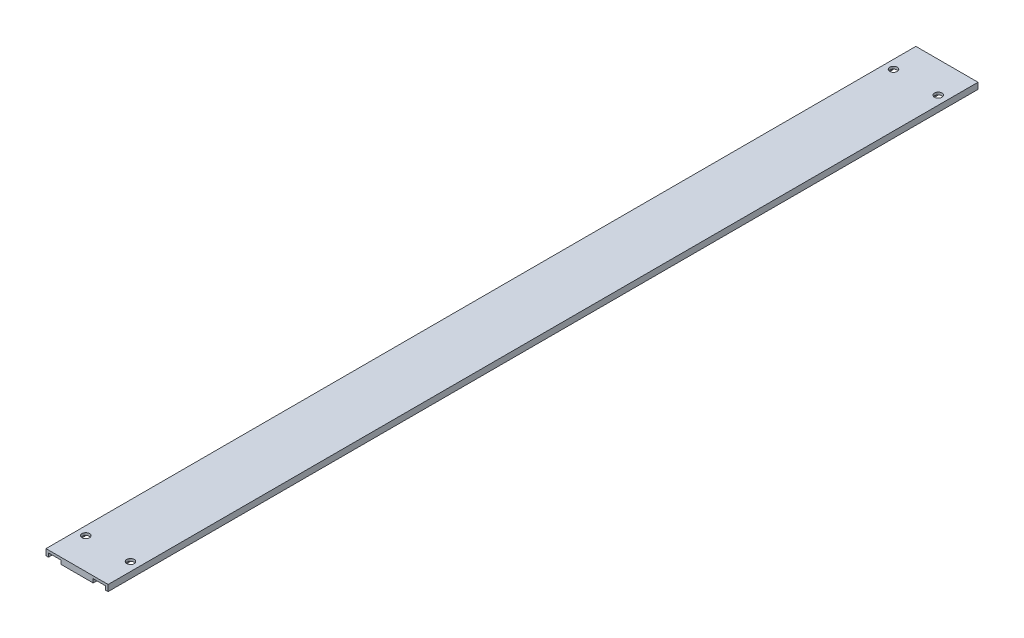
ISO-10303-21;
HEADER;
FILE_DESCRIPTION(('STEP AP214'),'2;1');
FILE_NAME('part.step','',(''),(''),'','','');
FILE_SCHEMA(('AUTOMOTIVE_DESIGN { 1 0 10303 214 1 1 1 1 }'));
ENDSEC;
DATA;
#1=APPLICATION_CONTEXT('core data for automotive mechanical design processes');
#2=APPLICATION_PROTOCOL_DEFINITION('international standard','automotive_design',2000,#1);
#3=PRODUCT_CONTEXT('',#1,'mechanical');
#4=PRODUCT('Part','Part','',(#3));
#5=PRODUCT_RELATED_PRODUCT_CATEGORY('part','',(#4));
#6=PRODUCT_DEFINITION_FORMATION('','',#4);
#7=PRODUCT_DEFINITION_CONTEXT('part definition',#1,'design');
#8=PRODUCT_DEFINITION('design','',#6,#7);
#9=PRODUCT_DEFINITION_SHAPE('','',#8);
#10=(LENGTH_UNIT() NAMED_UNIT(*) SI_UNIT(.MILLI.,.METRE.));
#11=(NAMED_UNIT(*) PLANE_ANGLE_UNIT() SI_UNIT($,.RADIAN.));
#12=(NAMED_UNIT(*) SI_UNIT($,.STERADIAN.) SOLID_ANGLE_UNIT());
#13=UNCERTAINTY_MEASURE_WITH_UNIT(LENGTH_MEASURE(1.E-05),#10,'distance_accuracy_value','');
#14=(GEOMETRIC_REPRESENTATION_CONTEXT(3) GLOBAL_UNCERTAINTY_ASSIGNED_CONTEXT((#13)) GLOBAL_UNIT_ASSIGNED_CONTEXT((#10,
#11,#12)) REPRESENTATION_CONTEXT('',''));
#15=CARTESIAN_POINT('',(0.,0.,0.));
#16=DIRECTION('',(0.,0.,1.));
#17=DIRECTION('',(1.,0.,0.));
#18=AXIS2_PLACEMENT_3D('',#15,#16,#17);
#19=CARTESIAN_POINT('',(0.,0.,0.));
#20=DIRECTION('',(0.,1.,0.));
#21=DIRECTION('',(0.,0.,1.));
#22=AXIS2_PLACEMENT_3D('',#19,#20,#21);
#23=PLANE('',#22);
#24=DIRECTION('',(-1.,0.,0.));
#25=VECTOR('',#24,1.);
#26=CARTESIAN_POINT('',(50.,0.,-700.));
#27=LINE('',#26,#25);
#28=CARTESIAN_POINT('',(2.,0.,-700.));
#29=VERTEX_POINT('',#28);
#30=CARTESIAN_POINT('',(0.,0.,-700.));
#31=VERTEX_POINT('',#30);
#32=EDGE_CURVE('E253',#29,#31,#27,.T.);
#33=ORIENTED_EDGE('',*,*,#32,.F.);
#34=DIRECTION('',(0.,0.,-1.));
#35=VECTOR('',#34,1.);
#36=CARTESIAN_POINT('',(2.,0.,-700.));
#37=LINE('',#36,#35);
#38=CARTESIAN_POINT('',(2.,0.,0.));
#39=VERTEX_POINT('',#38);
#40=EDGE_CURVE('E149',#39,#29,#37,.T.);
#41=ORIENTED_EDGE('',*,*,#40,.F.);
#42=DIRECTION('',(1.,0.,0.));
#43=VECTOR('',#42,1.);
#44=CARTESIAN_POINT('',(0.,0.,0.));
#45=LINE('',#44,#43);
#46=CARTESIAN_POINT('',(0.,0.,0.));
#47=VERTEX_POINT('',#46);
#48=EDGE_CURVE('E245',#47,#39,#45,.T.);
#49=ORIENTED_EDGE('',*,*,#48,.F.);
#50=DIRECTION('',(0.,0.,1.));
#51=VECTOR('',#50,1.);
#52=CARTESIAN_POINT('',(0.,0.,-700.));
#53=LINE('',#52,#51);
#54=EDGE_CURVE('E225',#31,#47,#53,.T.);
#55=ORIENTED_EDGE('',*,*,#54,.F.);
#56=EDGE_LOOP('',(#33,#41,#49,#55));
#57=FACE_BOUND('',#56,.T.);
#58=ADVANCED_FACE('F39',(#57),#23,.F.);
#59=CARTESIAN_POINT('',(12.,0.,0.));
#60=VERTEX_POINT('',#59);
#61=CARTESIAN_POINT('',(38.,0.,0.));
#62=VERTEX_POINT('',#61);
#63=EDGE_CURVE('E250',#60,#62,#45,.T.);
#64=ORIENTED_EDGE('',*,*,#63,.F.);
#65=DIRECTION('',(0.,0.,1.));
#66=VECTOR('',#65,1.);
#67=CARTESIAN_POINT('',(12.,0.,0.));
#68=LINE('',#67,#66);
#69=CARTESIAN_POINT('',(12.,0.,-700.));
#70=VERTEX_POINT('',#69);
#71=EDGE_CURVE('E191',#70,#60,#68,.T.);
#72=ORIENTED_EDGE('',*,*,#71,.F.);
#73=CARTESIAN_POINT('',(38.,0.,-700.));
#74=VERTEX_POINT('',#73);
#75=EDGE_CURVE('E155',#74,#70,#27,.T.);
#76=ORIENTED_EDGE('',*,*,#75,.F.);
#77=DIRECTION('',(0.,0.,-1.));
#78=VECTOR('',#77,1.);
#79=CARTESIAN_POINT('',(38.,0.,0.));
#80=LINE('',#79,#78);
#81=EDGE_CURVE('E183',#62,#74,#80,.T.);
#82=ORIENTED_EDGE('',*,*,#81,.F.);
#83=EDGE_LOOP('',(#64,#72,#76,#82));
#84=FACE_BOUND('',#83,.T.);
#85=ADVANCED_FACE('F313',(#84),#23,.F.);
#86=CARTESIAN_POINT('',(43.,0.,-25.));
#87=DIRECTION('',(0.,1.,0.));
#88=DIRECTION('',(0.,0.,1.));
#89=AXIS2_PLACEMENT_3D('',#86,#87,#88);
#90=CYLINDRICAL_SURFACE('',#89,3.);
#91=CARTESIAN_POINT('',(43.,5.,-25.));
#92=DIRECTION('',(0.,1.,0.));
#93=DIRECTION('',(0.,0.,1.));
#94=AXIS2_PLACEMENT_3D('',#91,#92,#93);
#95=CIRCLE('',#94,3.);
#96=CARTESIAN_POINT('',(43.,5.,-22.));
#97=VERTEX_POINT('',#96);
#98=EDGE_CURVE('E218',#97,#97,#95,.T.);
#99=ORIENTED_EDGE('',*,*,#98,.T.);
#100=EDGE_LOOP('',(#99));
#101=FACE_BOUND('',#100,.T.);
#102=CARTESIAN_POINT('',(43.,3.,-25.));
#103=DIRECTION('',(0.,-1.,0.));
#104=DIRECTION('',(0.,0.,-1.));
#105=AXIS2_PLACEMENT_3D('',#102,#103,#104);
#106=CIRCLE('',#105,3.);
#107=CARTESIAN_POINT('',(43.,3.,-28.));
#108=VERTEX_POINT('',#107);
#109=EDGE_CURVE('E205',#108,#108,#106,.F.);
#110=ORIENTED_EDGE('',*,*,#109,.F.);
#111=EDGE_LOOP('',(#110));
#112=FACE_BOUND('',#111,.T.);
#113=ADVANCED_FACE('F305',(#101,#112),#90,.F.);
#114=CARTESIAN_POINT('',(43.,0.,-675.));
#115=DIRECTION('',(0.,1.,0.));
#116=DIRECTION('',(0.,0.,1.));
#117=AXIS2_PLACEMENT_3D('',#114,#115,#116);
#118=CYLINDRICAL_SURFACE('',#117,3.);
#119=CARTESIAN_POINT('',(43.,5.,-675.));
#120=DIRECTION('',(0.,1.,0.));
#121=DIRECTION('',(0.,0.,1.));
#122=AXIS2_PLACEMENT_3D('',#119,#120,#121);
#123=CIRCLE('',#122,3.);
#124=CARTESIAN_POINT('',(43.,5.,-672.));
#125=VERTEX_POINT('',#124);
#126=EDGE_CURVE('E213',#125,#125,#123,.T.);
#127=ORIENTED_EDGE('',*,*,#126,.T.);
#128=EDGE_LOOP('',(#127));
#129=FACE_BOUND('',#128,.T.);
#130=CARTESIAN_POINT('',(43.,3.,-675.));
#131=DIRECTION('',(0.,-1.,0.));
#132=DIRECTION('',(0.,0.,-1.));
#133=AXIS2_PLACEMENT_3D('',#130,#131,#132);
#134=CIRCLE('',#133,3.);
#135=CARTESIAN_POINT('',(43.,3.,-678.));
#136=VERTEX_POINT('',#135);
#137=EDGE_CURVE('E43',#136,#136,#134,.F.);
#138=ORIENTED_EDGE('',*,*,#137,.F.);
#139=EDGE_LOOP('',(#138));
#140=FACE_BOUND('',#139,.T.);
#141=ADVANCED_FACE('F303',(#129,#140),#118,.F.);
#142=CARTESIAN_POINT('',(0.,5.,-700.));
#143=DIRECTION('',(1.,0.,0.));
#144=DIRECTION('',(0.,0.,-1.));
#145=AXIS2_PLACEMENT_3D('',#142,#143,#144);
#146=PLANE('',#145);
#147=ORIENTED_EDGE('',*,*,#54,.T.);
#148=DIRECTION('',(0.,-1.,0.));
#149=VECTOR('',#148,1.);
#150=CARTESIAN_POINT('',(0.,5.,0.));
#151=LINE('',#150,#149);
#152=CARTESIAN_POINT('',(0.,5.,0.));
#153=VERTEX_POINT('',#152);
#154=EDGE_CURVE('E11',#153,#47,#151,.T.);
#155=ORIENTED_EDGE('',*,*,#154,.F.);
#156=DIRECTION('',(0.,0.,1.));
#157=VECTOR('',#156,1.);
#158=CARTESIAN_POINT('',(0.,5.,-700.));
#159=LINE('',#158,#157);
#160=CARTESIAN_POINT('',(0.,5.,-700.));
#161=VERTEX_POINT('',#160);
#162=EDGE_CURVE('E226',#161,#153,#159,.T.);
#163=ORIENTED_EDGE('',*,*,#162,.F.);
#164=DIRECTION('',(0.,-1.,0.));
#165=VECTOR('',#164,1.);
#166=CARTESIAN_POINT('',(0.,5.,-700.));
#167=LINE('',#166,#165);
#168=EDGE_CURVE('E240',#161,#31,#167,.T.);
#169=ORIENTED_EDGE('',*,*,#168,.T.);
#170=EDGE_LOOP('',(#147,#155,#163,#169));
#171=FACE_BOUND('',#170,.T.);
#172=ADVANCED_FACE('F41',(#171),#146,.F.);
#173=CARTESIAN_POINT('',(0.,5.,0.));
#174=DIRECTION('',(0.,0.,-1.));
#175=DIRECTION('',(-1.,0.,0.));
#176=AXIS2_PLACEMENT_3D('',#173,#174,#175);
#177=PLANE('',#176);
#178=ORIENTED_EDGE('',*,*,#48,.T.);
#179=DIRECTION('',(0.,-1.,0.));
#180=VECTOR('',#179,1.);
#181=CARTESIAN_POINT('',(2.,3.,0.));
#182=LINE('',#181,#180);
#183=CARTESIAN_POINT('',(2.,3.,0.));
#184=VERTEX_POINT('',#183);
#185=EDGE_CURVE('E160',#184,#39,#182,.T.);
#186=ORIENTED_EDGE('',*,*,#185,.F.);
#187=DIRECTION('',(-1.,0.,0.));
#188=VECTOR('',#187,1.);
#189=CARTESIAN_POINT('',(2.,3.,0.));
#190=LINE('',#189,#188);
#191=CARTESIAN_POINT('',(12.,3.,0.));
#192=VERTEX_POINT('',#191);
#193=EDGE_CURVE('E137',#192,#184,#190,.T.);
#194=ORIENTED_EDGE('',*,*,#193,.F.);
#195=DIRECTION('',(0.,-1.,0.));
#196=VECTOR('',#195,1.);
#197=CARTESIAN_POINT('',(12.,3.,0.));
#198=LINE('',#197,#196);
#199=EDGE_CURVE('E133',#192,#60,#198,.T.);
#200=ORIENTED_EDGE('',*,*,#199,.T.);
#201=ORIENTED_EDGE('',*,*,#63,.T.);
#202=DIRECTION('',(0.,-1.,0.));
#203=VECTOR('',#202,1.);
#204=CARTESIAN_POINT('',(38.,3.,0.));
#205=LINE('',#204,#203);
#206=CARTESIAN_POINT('',(38.,3.,0.));
#207=VERTEX_POINT('',#206);
#208=EDGE_CURVE('E188',#207,#62,#205,.T.);
#209=ORIENTED_EDGE('',*,*,#208,.F.);
#210=DIRECTION('',(-1.,0.,0.));
#211=VECTOR('',#210,1.);
#212=CARTESIAN_POINT('',(38.,3.,0.));
#213=LINE('',#212,#211);
#214=CARTESIAN_POINT('',(48.,3.,0.));
#215=VERTEX_POINT('',#214);
#216=EDGE_CURVE('E178',#215,#207,#213,.T.);
#217=ORIENTED_EDGE('',*,*,#216,.F.);
#218=DIRECTION('',(0.,-1.,0.));
#219=VECTOR('',#218,1.);
#220=CARTESIAN_POINT('',(48.,3.,0.));
#221=LINE('',#220,#219);
#222=CARTESIAN_POINT('',(48.,0.,0.));
#223=VERTEX_POINT('',#222);
#224=EDGE_CURVE('E192',#215,#223,#221,.T.);
#225=ORIENTED_EDGE('',*,*,#224,.T.);
#226=CARTESIAN_POINT('',(50.,0.,0.));
#227=VERTEX_POINT('',#226);
#228=EDGE_CURVE('E244',#223,#227,#45,.T.);
#229=ORIENTED_EDGE('',*,*,#228,.T.);
#230=DIRECTION('',(0.,-1.,0.));
#231=VECTOR('',#230,1.);
#232=CARTESIAN_POINT('',(50.,5.,0.));
#233=LINE('',#232,#231);
#234=CARTESIAN_POINT('',(50.,5.,0.));
#235=VERTEX_POINT('',#234);
#236=EDGE_CURVE('E49',#235,#227,#233,.T.);
#237=ORIENTED_EDGE('',*,*,#236,.F.);
#238=DIRECTION('',(1.,0.,0.));
#239=VECTOR('',#238,1.);
#240=CARTESIAN_POINT('',(0.,5.,0.));
#241=LINE('',#240,#239);
#242=EDGE_CURVE('E230',#153,#235,#241,.T.);
#243=ORIENTED_EDGE('',*,*,#242,.F.);
#244=ORIENTED_EDGE('',*,*,#154,.T.);
#245=EDGE_LOOP('',(#178,#186,#194,#200,#201,#209,#217,#225,#229,#237,#243,#244));
#246=FACE_BOUND('',#245,.T.);
#247=ADVANCED_FACE('F286',(#246),#177,.F.);
#248=CARTESIAN_POINT('',(50.,5.,0.));
#249=DIRECTION('',(-1.,0.,0.));
#250=DIRECTION('',(0.,0.,1.));
#251=AXIS2_PLACEMENT_3D('',#248,#249,#250);
#252=PLANE('',#251);
#253=DIRECTION('',(0.,0.,-1.));
#254=VECTOR('',#253,1.);
#255=CARTESIAN_POINT('',(50.,0.,0.));
#256=LINE('',#255,#254);
#257=CARTESIAN_POINT('',(50.,0.,-700.));
#258=VERTEX_POINT('',#257);
#259=EDGE_CURVE('E249',#227,#258,#256,.T.);
#260=ORIENTED_EDGE('',*,*,#259,.T.);
#261=DIRECTION('',(0.,-1.,0.));
#262=VECTOR('',#261,1.);
#263=CARTESIAN_POINT('',(50.,5.,-700.));
#264=LINE('',#263,#262);
#265=CARTESIAN_POINT('',(50.,5.,-700.));
#266=VERTEX_POINT('',#265);
#267=EDGE_CURVE('E260',#266,#258,#264,.T.);
#268=ORIENTED_EDGE('',*,*,#267,.F.);
#269=DIRECTION('',(0.,0.,-1.));
#270=VECTOR('',#269,1.);
#271=CARTESIAN_POINT('',(50.,5.,0.));
#272=LINE('',#271,#270);
#273=EDGE_CURVE('E234',#235,#266,#272,.T.);
#274=ORIENTED_EDGE('',*,*,#273,.F.);
#275=ORIENTED_EDGE('',*,*,#236,.T.);
#276=EDGE_LOOP('',(#260,#268,#274,#275));
#277=FACE_BOUND('',#276,.T.);
#278=ADVANCED_FACE('F345',(#277),#252,.F.);
#279=CARTESIAN_POINT('',(50.,5.,-700.));
#280=DIRECTION('',(0.,0.,1.));
#281=DIRECTION('',(1.,0.,0.));
#282=AXIS2_PLACEMENT_3D('',#279,#280,#281);
#283=PLANE('',#282);
#284=DIRECTION('',(1.,0.,0.));
#285=VECTOR('',#284,1.);
#286=CARTESIAN_POINT('',(12.,3.,-700.));
#287=LINE('',#286,#285);
#288=CARTESIAN_POINT('',(2.,3.,-700.));
#289=VERTEX_POINT('',#288);
#290=CARTESIAN_POINT('',(12.,3.,-700.));
#291=VERTEX_POINT('',#290);
#292=EDGE_CURVE('E138',#289,#291,#287,.T.);
#293=ORIENTED_EDGE('',*,*,#292,.F.);
#294=DIRECTION('',(0.,-1.,0.));
#295=VECTOR('',#294,1.);
#296=CARTESIAN_POINT('',(2.,3.,-700.));
#297=LINE('',#296,#295);
#298=EDGE_CURVE('E268',#289,#29,#297,.T.);
#299=ORIENTED_EDGE('',*,*,#298,.T.);
#300=ORIENTED_EDGE('',*,*,#32,.T.);
#301=ORIENTED_EDGE('',*,*,#168,.F.);
#302=DIRECTION('',(-1.,0.,0.));
#303=VECTOR('',#302,1.);
#304=CARTESIAN_POINT('',(50.,5.,-700.));
#305=LINE('',#304,#303);
#306=EDGE_CURVE('E237',#266,#161,#305,.T.);
#307=ORIENTED_EDGE('',*,*,#306,.F.);
#308=ORIENTED_EDGE('',*,*,#267,.T.);
#309=CARTESIAN_POINT('',(48.,0.,-700.));
#310=VERTEX_POINT('',#309);
#311=EDGE_CURVE('E231',#258,#310,#27,.T.);
#312=ORIENTED_EDGE('',*,*,#311,.T.);
#313=DIRECTION('',(0.,-1.,0.));
#314=VECTOR('',#313,1.);
#315=CARTESIAN_POINT('',(48.,3.,-700.));
#316=LINE('',#315,#314);
#317=CARTESIAN_POINT('',(48.,3.,-700.));
#318=VERTEX_POINT('',#317);
#319=EDGE_CURVE('E65',#318,#310,#316,.T.);
#320=ORIENTED_EDGE('',*,*,#319,.F.);
#321=DIRECTION('',(1.,0.,0.));
#322=VECTOR('',#321,1.);
#323=CARTESIAN_POINT('',(38.,3.,-700.));
#324=LINE('',#323,#322);
#325=CARTESIAN_POINT('',(38.,3.,-700.));
#326=VERTEX_POINT('',#325);
#327=EDGE_CURVE('E169',#326,#318,#324,.T.);
#328=ORIENTED_EDGE('',*,*,#327,.F.);
#329=DIRECTION('',(0.,-1.,0.));
#330=VECTOR('',#329,1.);
#331=CARTESIAN_POINT('',(38.,3.,-700.));
#332=LINE('',#331,#330);
#333=EDGE_CURVE('E182',#326,#74,#332,.T.);
#334=ORIENTED_EDGE('',*,*,#333,.T.);
#335=ORIENTED_EDGE('',*,*,#75,.T.);
#336=DIRECTION('',(0.,-1.,0.));
#337=VECTOR('',#336,1.);
#338=CARTESIAN_POINT('',(12.,3.,-700.));
#339=LINE('',#338,#337);
#340=EDGE_CURVE('E57',#291,#70,#339,.T.);
#341=ORIENTED_EDGE('',*,*,#340,.F.);
#342=EDGE_LOOP('',(#293,#299,#300,#301,#307,#308,#312,#320,#328,#334,#335,#341));
#343=FACE_BOUND('',#342,.T.);
#344=ADVANCED_FACE('F152',(#343),#283,.F.);
#345=CARTESIAN_POINT('',(0.,5.,0.));
#346=DIRECTION('',(0.,1.,0.));
#347=DIRECTION('',(0.,0.,1.));
#348=AXIS2_PLACEMENT_3D('',#345,#346,#347);
#349=PLANE('',#348);
#350=CARTESIAN_POINT('',(7.,5.,-25.));
#351=DIRECTION('',(0.,1.,0.));
#352=DIRECTION('',(0.,0.,1.));
#353=AXIS2_PLACEMENT_3D('',#350,#351,#352);
#354=CIRCLE('',#353,3.);
#355=CARTESIAN_POINT('',(7.,5.,-22.));
#356=VERTEX_POINT('',#355);
#357=EDGE_CURVE('E214',#356,#356,#354,.T.);
#358=ORIENTED_EDGE('',*,*,#357,.F.);
#359=EDGE_LOOP('',(#358));
#360=FACE_BOUND('',#359,.T.);
#361=ORIENTED_EDGE('',*,*,#126,.F.);
#362=EDGE_LOOP('',(#361));
#363=FACE_BOUND('',#362,.T.);
#364=CARTESIAN_POINT('',(7.,5.,-675.));
#365=DIRECTION('',(0.,1.,0.));
#366=DIRECTION('',(0.,0.,1.));
#367=AXIS2_PLACEMENT_3D('',#364,#365,#366);
#368=CIRCLE('',#367,3.);
#369=CARTESIAN_POINT('',(7.,5.,-672.));
#370=VERTEX_POINT('',#369);
#371=EDGE_CURVE('E209',#370,#370,#368,.T.);
#372=ORIENTED_EDGE('',*,*,#371,.F.);
#373=EDGE_LOOP('',(#372));
#374=FACE_BOUND('',#373,.T.);
#375=ORIENTED_EDGE('',*,*,#98,.F.);
#376=EDGE_LOOP('',(#375));
#377=FACE_BOUND('',#376,.T.);
#378=ORIENTED_EDGE('',*,*,#162,.T.);
#379=ORIENTED_EDGE('',*,*,#242,.T.);
#380=ORIENTED_EDGE('',*,*,#273,.T.);
#381=ORIENTED_EDGE('',*,*,#306,.T.);
#382=EDGE_LOOP('',(#378,#379,#380,#381));
#383=FACE_BOUND('',#382,.T.);
#384=ADVANCED_FACE('F328',(#360,#363,#374,#377,#383),#349,.T.);
#385=ORIENTED_EDGE('',*,*,#228,.F.);
#386=DIRECTION('',(0.,0.,1.));
#387=VECTOR('',#386,1.);
#388=CARTESIAN_POINT('',(48.,0.,0.));
#389=LINE('',#388,#387);
#390=EDGE_CURVE('E170',#310,#223,#389,.T.);
#391=ORIENTED_EDGE('',*,*,#390,.F.);
#392=ORIENTED_EDGE('',*,*,#311,.F.);
#393=ORIENTED_EDGE('',*,*,#259,.F.);
#394=EDGE_LOOP('',(#385,#391,#392,#393));
#395=FACE_BOUND('',#394,.T.);
#396=ADVANCED_FACE('F319',(#395),#23,.F.);
#397=CARTESIAN_POINT('',(7.,0.,-675.));
#398=DIRECTION('',(0.,1.,0.));
#399=DIRECTION('',(0.,0.,1.));
#400=AXIS2_PLACEMENT_3D('',#397,#398,#399);
#401=CYLINDRICAL_SURFACE('',#400,3.);
#402=CARTESIAN_POINT('',(7.,3.,-675.));
#403=DIRECTION('',(0.,1.,0.));
#404=DIRECTION('',(0.,0.,1.));
#405=AXIS2_PLACEMENT_3D('',#402,#403,#404);
#406=CIRCLE('',#405,3.);
#407=CARTESIAN_POINT('',(7.,3.,-672.));
#408=VERTEX_POINT('',#407);
#409=EDGE_CURVE('E200',#408,#408,#406,.F.);
#410=ORIENTED_EDGE('',*,*,#409,.T.);
#411=EDGE_LOOP('',(#410));
#412=FACE_BOUND('',#411,.T.);
#413=ORIENTED_EDGE('',*,*,#371,.T.);
#414=EDGE_LOOP('',(#413));
#415=FACE_BOUND('',#414,.T.);
#416=ADVANCED_FACE('F327',(#412,#415),#401,.F.);
#417=CARTESIAN_POINT('',(7.,0.,-25.));
#418=DIRECTION('',(0.,1.,0.));
#419=DIRECTION('',(0.,0.,1.));
#420=AXIS2_PLACEMENT_3D('',#417,#418,#419);
#421=CYLINDRICAL_SURFACE('',#420,3.);
#422=CARTESIAN_POINT('',(7.,3.,-25.));
#423=DIRECTION('',(0.,1.,0.));
#424=DIRECTION('',(0.,0.,1.));
#425=AXIS2_PLACEMENT_3D('',#422,#423,#424);
#426=CIRCLE('',#425,3.);
#427=CARTESIAN_POINT('',(7.,3.,-22.));
#428=VERTEX_POINT('',#427);
#429=EDGE_CURVE('E204',#428,#428,#426,.F.);
#430=ORIENTED_EDGE('',*,*,#429,.T.);
#431=EDGE_LOOP('',(#430));
#432=FACE_BOUND('',#431,.T.);
#433=ORIENTED_EDGE('',*,*,#357,.T.);
#434=EDGE_LOOP('',(#433));
#435=FACE_BOUND('',#434,.T.);
#436=ADVANCED_FACE('F334',(#432,#435),#421,.F.);
#437=CARTESIAN_POINT('',(0.,3.,0.));
#438=DIRECTION('',(0.,1.,0.));
#439=DIRECTION('',(0.,0.,1.));
#440=AXIS2_PLACEMENT_3D('',#437,#438,#439);
#441=PLANE('',#440);
#442=ORIENTED_EDGE('',*,*,#429,.F.);
#443=EDGE_LOOP('',(#442));
#444=FACE_BOUND('',#443,.T.);
#445=ORIENTED_EDGE('',*,*,#292,.T.);
#446=DIRECTION('',(0.,0.,1.));
#447=VECTOR('',#446,1.);
#448=CARTESIAN_POINT('',(12.,3.,0.));
#449=LINE('',#448,#447);
#450=EDGE_CURVE('E129',#291,#192,#449,.T.);
#451=ORIENTED_EDGE('',*,*,#450,.T.);
#452=ORIENTED_EDGE('',*,*,#193,.T.);
#453=DIRECTION('',(0.,0.,-1.));
#454=VECTOR('',#453,1.);
#455=CARTESIAN_POINT('',(2.,3.,-700.));
#456=LINE('',#455,#454);
#457=EDGE_CURVE('E145',#184,#289,#456,.T.);
#458=ORIENTED_EDGE('',*,*,#457,.T.);
#459=EDGE_LOOP('',(#445,#451,#452,#458));
#460=FACE_BOUND('',#459,.T.);
#461=ORIENTED_EDGE('',*,*,#409,.F.);
#462=EDGE_LOOP('',(#461));
#463=FACE_BOUND('',#462,.T.);
#464=ADVANCED_FACE('F142',(#444,#460,#463),#441,.F.);
#465=CARTESIAN_POINT('',(2.,3.,-700.));
#466=DIRECTION('',(-1.,0.,0.));
#467=DIRECTION('',(0.,0.,1.));
#468=AXIS2_PLACEMENT_3D('',#465,#466,#467);
#469=PLANE('',#468);
#470=ORIENTED_EDGE('',*,*,#40,.T.);
#471=ORIENTED_EDGE('',*,*,#298,.F.);
#472=ORIENTED_EDGE('',*,*,#457,.F.);
#473=ORIENTED_EDGE('',*,*,#185,.T.);
#474=EDGE_LOOP('',(#470,#471,#472,#473));
#475=FACE_BOUND('',#474,.T.);
#476=ADVANCED_FACE('F284',(#475),#469,.F.);
#477=CARTESIAN_POINT('',(12.,3.,0.));
#478=DIRECTION('',(1.,0.,0.));
#479=DIRECTION('',(0.,0.,-1.));
#480=AXIS2_PLACEMENT_3D('',#477,#478,#479);
#481=PLANE('',#480);
#482=ORIENTED_EDGE('',*,*,#71,.T.);
#483=ORIENTED_EDGE('',*,*,#199,.F.);
#484=ORIENTED_EDGE('',*,*,#450,.F.);
#485=ORIENTED_EDGE('',*,*,#340,.T.);
#486=EDGE_LOOP('',(#482,#483,#484,#485));
#487=FACE_BOUND('',#486,.T.);
#488=ADVANCED_FACE('F131',(#487),#481,.F.);
#489=CARTESIAN_POINT('',(0.,3.,0.));
#490=DIRECTION('',(0.,-1.,0.));
#491=DIRECTION('',(0.,0.,-1.));
#492=AXIS2_PLACEMENT_3D('',#489,#490,#491);
#493=PLANE('',#492);
#494=DIRECTION('',(0.,0.,-1.));
#495=VECTOR('',#494,1.);
#496=CARTESIAN_POINT('',(38.,3.,0.));
#497=LINE('',#496,#495);
#498=EDGE_CURVE('E165',#207,#326,#497,.T.);
#499=ORIENTED_EDGE('',*,*,#498,.T.);
#500=ORIENTED_EDGE('',*,*,#327,.T.);
#501=DIRECTION('',(0.,0.,1.));
#502=VECTOR('',#501,1.);
#503=CARTESIAN_POINT('',(48.,3.,0.));
#504=LINE('',#503,#502);
#505=EDGE_CURVE('E174',#318,#215,#504,.T.);
#506=ORIENTED_EDGE('',*,*,#505,.T.);
#507=ORIENTED_EDGE('',*,*,#216,.T.);
#508=EDGE_LOOP('',(#499,#500,#506,#507));
#509=FACE_BOUND('',#508,.T.);
#510=ORIENTED_EDGE('',*,*,#137,.T.);
#511=EDGE_LOOP('',(#510));
#512=FACE_BOUND('',#511,.T.);
#513=ORIENTED_EDGE('',*,*,#109,.T.);
#514=EDGE_LOOP('',(#513));
#515=FACE_BOUND('',#514,.T.);
#516=ADVANCED_FACE('F300',(#509,#512,#515),#493,.T.);
#517=CARTESIAN_POINT('',(38.,3.,0.));
#518=DIRECTION('',(-1.,0.,0.));
#519=DIRECTION('',(0.,0.,1.));
#520=AXIS2_PLACEMENT_3D('',#517,#518,#519);
#521=PLANE('',#520);
#522=ORIENTED_EDGE('',*,*,#81,.T.);
#523=ORIENTED_EDGE('',*,*,#333,.F.);
#524=ORIENTED_EDGE('',*,*,#498,.F.);
#525=ORIENTED_EDGE('',*,*,#208,.T.);
#526=EDGE_LOOP('',(#522,#523,#524,#525));
#527=FACE_BOUND('',#526,.T.);
#528=ADVANCED_FACE('F354',(#527),#521,.F.);
#529=CARTESIAN_POINT('',(48.,3.,0.));
#530=DIRECTION('',(1.,0.,0.));
#531=DIRECTION('',(0.,0.,-1.));
#532=AXIS2_PLACEMENT_3D('',#529,#530,#531);
#533=PLANE('',#532);
#534=ORIENTED_EDGE('',*,*,#390,.T.);
#535=ORIENTED_EDGE('',*,*,#224,.F.);
#536=ORIENTED_EDGE('',*,*,#505,.F.);
#537=ORIENTED_EDGE('',*,*,#319,.T.);
#538=EDGE_LOOP('',(#534,#535,#536,#537));
#539=FACE_BOUND('',#538,.T.);
#540=ADVANCED_FACE('F358',(#539),#533,.F.);
#541=CLOSED_SHELL('',(#58,#85,#113,#141,#172,#247,#278,#344,#384,#396,#416,#436,#464,#476,#488,
#516,#528,#540));
#542=MANIFOLD_SOLID_BREP('B2',#541);
#543=ADVANCED_BREP_SHAPE_REPRESENTATION('',(#18,#542),#14);
#544=SHAPE_DEFINITION_REPRESENTATION(#9,#543);
ENDSEC;
END-ISO-10303-21;
